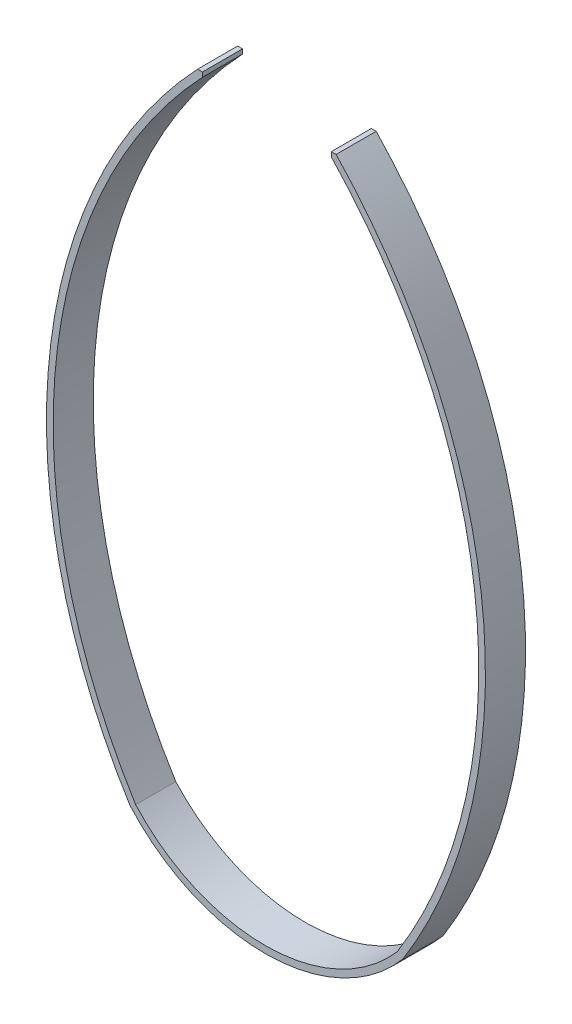
ISO-10303-21;
HEADER;
FILE_DESCRIPTION(('STEP AP214'),'2;1');
FILE_NAME('part.step','',(''),(''),'','','');
FILE_SCHEMA(('AUTOMOTIVE_DESIGN { 1 0 10303 214 1 1 1 1 }'));
ENDSEC;
DATA;
#1=APPLICATION_CONTEXT('core data for automotive mechanical design processes');
#2=APPLICATION_PROTOCOL_DEFINITION('international standard','automotive_design',2000,#1);
#3=PRODUCT_CONTEXT('',#1,'mechanical');
#4=PRODUCT('Part','Part','',(#3));
#5=PRODUCT_RELATED_PRODUCT_CATEGORY('part','',(#4));
#6=PRODUCT_DEFINITION_FORMATION('','',#4);
#7=PRODUCT_DEFINITION_CONTEXT('part definition',#1,'design');
#8=PRODUCT_DEFINITION('design','',#6,#7);
#9=PRODUCT_DEFINITION_SHAPE('','',#8);
#10=(LENGTH_UNIT() NAMED_UNIT(*) SI_UNIT(.MILLI.,.METRE.));
#11=(NAMED_UNIT(*) PLANE_ANGLE_UNIT() SI_UNIT($,.RADIAN.));
#12=(NAMED_UNIT(*) SI_UNIT($,.STERADIAN.) SOLID_ANGLE_UNIT());
#13=UNCERTAINTY_MEASURE_WITH_UNIT(LENGTH_MEASURE(1.E-05),#10,'distance_accuracy_value','');
#14=(GEOMETRIC_REPRESENTATION_CONTEXT(3) GLOBAL_UNCERTAINTY_ASSIGNED_CONTEXT((#13)) GLOBAL_UNIT_ASSIGNED_CONTEXT((#10,
#11,#12)) REPRESENTATION_CONTEXT('',''));
#15=CARTESIAN_POINT('',(0.,0.,0.));
#16=DIRECTION('',(0.,0.,1.));
#17=DIRECTION('',(1.,0.,0.));
#18=AXIS2_PLACEMENT_3D('',#15,#16,#17);
#19=CARTESIAN_POINT('',(246.446674144298,-17.5416481141906,30.));
#20=DIRECTION('',(0.,0.,-1.));
#21=DIRECTION('',(-1.,0.,0.));
#22=AXIS2_PLACEMENT_3D('',#19,#20,#21);
#23=CYLINDRICAL_SURFACE('',#22,408.152597482602);
#24=CARTESIAN_POINT('',(246.446674144298,-17.5416481141906,0.));
#25=DIRECTION('',(0.,0.,-1.));
#26=DIRECTION('',(1.,0.,0.));
#27=AXIS2_PLACEMENT_3D('',#24,#25,#26);
#28=CIRCLE('',#27,408.152597482602);
#29=CARTESIAN_POINT('',(-99.9773100852347,-233.363254961909,0.));
#30=VERTEX_POINT('',#29);
#31=CARTESIAN_POINT('',(-50.,263.007656323691,0.));
#32=VERTEX_POINT('',#31);
#33=EDGE_CURVE('E140',#30,#32,#28,.T.);
#34=ORIENTED_EDGE('',*,*,#33,.T.);
#35=DIRECTION('',(0.,0.,-1.));
#36=VECTOR('',#35,1.);
#37=CARTESIAN_POINT('',(-50.,263.007656323691,30.));
#38=LINE('',#37,#36);
#39=CARTESIAN_POINT('',(-50.,263.007656323691,30.));
#40=VERTEX_POINT('',#39);
#41=EDGE_CURVE('E11',#40,#32,#38,.T.);
#42=ORIENTED_EDGE('',*,*,#41,.F.);
#43=CARTESIAN_POINT('',(246.446674144298,-17.5416481141906,30.));
#44=DIRECTION('',(0.,0.,-1.));
#45=DIRECTION('',(1.,0.,0.));
#46=AXIS2_PLACEMENT_3D('',#43,#44,#45);
#47=CIRCLE('',#46,408.152597482602);
#48=CARTESIAN_POINT('',(-99.9773100852347,-233.363254961909,30.));
#49=VERTEX_POINT('',#48);
#50=EDGE_CURVE('E158',#49,#40,#47,.T.);
#51=ORIENTED_EDGE('',*,*,#50,.F.);
#52=DIRECTION('',(0.,0.,-1.));
#53=VECTOR('',#52,1.);
#54=CARTESIAN_POINT('',(-99.9773100852347,-233.363254961909,30.));
#55=LINE('',#54,#53);
#56=EDGE_CURVE('E136',#49,#30,#55,.T.);
#57=ORIENTED_EDGE('',*,*,#56,.T.);
#58=EDGE_LOOP('',(#34,#42,#51,#57));
#59=FACE_BOUND('',#58,.T.);
#60=ADVANCED_FACE('F32',(#59),#23,.F.);
#61=CARTESIAN_POINT('',(-50.,266.444475128327,30.));
#62=DIRECTION('',(-1.,0.,0.));
#63=DIRECTION('',(0.,0.,1.));
#64=AXIS2_PLACEMENT_3D('',#61,#62,#63);
#65=PLANE('',#64);
#66=DIRECTION('',(0.,1.,0.));
#67=VECTOR('',#66,1.);
#68=CARTESIAN_POINT('',(-50.,266.444475128327,0.));
#69=LINE('',#68,#67);
#70=CARTESIAN_POINT('',(-50.,266.444475128327,0.));
#71=VERTEX_POINT('',#70);
#72=EDGE_CURVE('E143',#32,#71,#69,.T.);
#73=ORIENTED_EDGE('',*,*,#72,.T.);
#74=DIRECTION('',(0.,0.,-1.));
#75=VECTOR('',#74,1.);
#76=CARTESIAN_POINT('',(-50.,266.444475128327,30.));
#77=LINE('',#76,#75);
#78=CARTESIAN_POINT('',(-50.,266.444475128327,30.));
#79=VERTEX_POINT('',#78);
#80=EDGE_CURVE('E40',#79,#71,#77,.T.);
#81=ORIENTED_EDGE('',*,*,#80,.F.);
#82=DIRECTION('',(0.,1.,0.));
#83=VECTOR('',#82,1.);
#84=CARTESIAN_POINT('',(-50.,266.444475128327,30.));
#85=LINE('',#84,#83);
#86=EDGE_CURVE('E97',#40,#79,#85,.T.);
#87=ORIENTED_EDGE('',*,*,#86,.F.);
#88=ORIENTED_EDGE('',*,*,#41,.T.);
#89=EDGE_LOOP('',(#73,#81,#87,#88));
#90=FACE_BOUND('',#89,.T.);
#91=ADVANCED_FACE('F207',(#90),#65,.F.);
#92=CARTESIAN_POINT('',(-53.6315666735031,266.444475128327,30.));
#93=DIRECTION('',(0.,-1.,0.));
#94=DIRECTION('',(0.,0.,-1.));
#95=AXIS2_PLACEMENT_3D('',#92,#93,#94);
#96=PLANE('',#95);
#97=DIRECTION('',(-1.,0.,0.));
#98=VECTOR('',#97,1.);
#99=CARTESIAN_POINT('',(-53.6315666735031,266.444475128327,0.));
#100=LINE('',#99,#98);
#101=CARTESIAN_POINT('',(-53.6315666735031,266.444475128327,0.));
#102=VERTEX_POINT('',#101);
#103=EDGE_CURVE('E145',#71,#102,#100,.T.);
#104=ORIENTED_EDGE('',*,*,#103,.T.);
#105=DIRECTION('',(0.,0.,-1.));
#106=VECTOR('',#105,1.);
#107=CARTESIAN_POINT('',(-53.6315666735031,266.444475128327,30.));
#108=LINE('',#107,#106);
#109=CARTESIAN_POINT('',(-53.6315666735031,266.444475128327,30.));
#110=VERTEX_POINT('',#109);
#111=EDGE_CURVE('E171',#110,#102,#108,.T.);
#112=ORIENTED_EDGE('',*,*,#111,.F.);
#113=DIRECTION('',(-1.,0.,0.));
#114=VECTOR('',#113,1.);
#115=CARTESIAN_POINT('',(-53.6315666735031,266.444475128327,30.));
#116=LINE('',#115,#114);
#117=EDGE_CURVE('E179',#79,#110,#116,.T.);
#118=ORIENTED_EDGE('',*,*,#117,.F.);
#119=ORIENTED_EDGE('',*,*,#80,.T.);
#120=EDGE_LOOP('',(#104,#112,#118,#119));
#121=FACE_BOUND('',#120,.T.);
#122=ADVANCED_FACE('F177',(#121),#96,.F.);
#123=CARTESIAN_POINT('',(246.446674144298,-17.5416481141906,30.));
#124=DIRECTION('',(0.,0.,-1.));
#125=DIRECTION('',(-1.,0.,0.));
#126=AXIS2_PLACEMENT_3D('',#123,#124,#125);
#127=CYLINDRICAL_SURFACE('',#126,413.152597482602);
#128=CARTESIAN_POINT('',(246.446674144298,-17.5416481141906,0.));
#129=DIRECTION('',(0.,0.,1.));
#130=DIRECTION('',(1.,0.,0.));
#131=AXIS2_PLACEMENT_3D('',#128,#129,#130);
#132=CIRCLE('',#131,413.152597482602);
#133=CARTESIAN_POINT('',(-104.221114808838,-236.007138746783,0.));
#134=VERTEX_POINT('',#133);
#135=EDGE_CURVE('E147',#102,#134,#132,.T.);
#136=ORIENTED_EDGE('',*,*,#135,.T.);
#137=DIRECTION('',(0.,0.,-1.));
#138=VECTOR('',#137,1.);
#139=CARTESIAN_POINT('',(-104.221114808838,-236.007138746783,30.));
#140=LINE('',#139,#138);
#141=CARTESIAN_POINT('',(-104.221114808838,-236.007138746783,30.));
#142=VERTEX_POINT('',#141);
#143=EDGE_CURVE('E168',#142,#134,#140,.T.);
#144=ORIENTED_EDGE('',*,*,#143,.F.);
#145=CARTESIAN_POINT('',(246.446674144298,-17.5416481141906,30.));
#146=DIRECTION('',(0.,0.,1.));
#147=DIRECTION('',(1.,0.,0.));
#148=AXIS2_PLACEMENT_3D('',#145,#146,#147);
#149=CIRCLE('',#148,413.152597482602);
#150=EDGE_CURVE('E197',#110,#142,#149,.T.);
#151=ORIENTED_EDGE('',*,*,#150,.F.);
#152=ORIENTED_EDGE('',*,*,#111,.T.);
#153=EDGE_LOOP('',(#136,#144,#151,#152));
#154=FACE_BOUND('',#153,.T.);
#155=ADVANCED_FACE('F188',(#154),#127,.T.);
#156=CARTESIAN_POINT('',(-3.26554658618699,-146.356674021873,30.));
#157=DIRECTION('',(0.,0.,-1.));
#158=DIRECTION('',(-1.,0.,0.));
#159=AXIS2_PLACEMENT_3D('',#156,#157,#158);
#160=CYLINDRICAL_SURFACE('',#159,135.015675314205);
#161=CARTESIAN_POINT('',(-3.26554658618699,-146.356674021873,0.));
#162=DIRECTION('',(0.,0.,1.));
#163=DIRECTION('',(-1.,0.,0.));
#164=AXIS2_PLACEMENT_3D('',#161,#162,#163);
#165=CIRCLE('',#164,135.015675314205);
#166=CARTESIAN_POINT('',(99.9773100852347,-233.363254961909,0.));
#167=VERTEX_POINT('',#166);
#168=EDGE_CURVE('E149',#134,#167,#165,.T.);
#169=ORIENTED_EDGE('',*,*,#168,.T.);
#170=DIRECTION('',(0.,0.,-1.));
#171=VECTOR('',#170,1.);
#172=CARTESIAN_POINT('',(99.9773100852347,-233.363254961909,30.));
#173=LINE('',#172,#171);
#174=CARTESIAN_POINT('',(99.9773100852347,-233.363254961909,30.));
#175=VERTEX_POINT('',#174);
#176=EDGE_CURVE('E165',#175,#167,#173,.T.);
#177=ORIENTED_EDGE('',*,*,#176,.F.);
#178=CARTESIAN_POINT('',(-3.26554658618699,-146.356674021873,30.));
#179=DIRECTION('',(0.,0.,1.));
#180=DIRECTION('',(-1.,0.,0.));
#181=AXIS2_PLACEMENT_3D('',#178,#179,#180);
#182=CIRCLE('',#181,135.015675314205);
#183=EDGE_CURVE('E194',#142,#175,#182,.T.);
#184=ORIENTED_EDGE('',*,*,#183,.F.);
#185=ORIENTED_EDGE('',*,*,#143,.T.);
#186=EDGE_LOOP('',(#169,#177,#184,#185));
#187=FACE_BOUND('',#186,.T.);
#188=ADVANCED_FACE('F192',(#187),#160,.T.);
#189=CARTESIAN_POINT('',(-246.446674144298,-17.5416481141906,30.));
#190=DIRECTION('',(0.,0.,-1.));
#191=DIRECTION('',(-1.,0.,0.));
#192=AXIS2_PLACEMENT_3D('',#189,#190,#191);
#193=CYLINDRICAL_SURFACE('',#192,408.152597482602);
#194=CARTESIAN_POINT('',(-246.446674144298,-17.5416481141906,0.));
#195=DIRECTION('',(0.,0.,1.));
#196=DIRECTION('',(-1.,0.,0.));
#197=AXIS2_PLACEMENT_3D('',#194,#195,#196);
#198=CIRCLE('',#197,408.152597482602);
#199=CARTESIAN_POINT('',(50.,263.007656323691,0.));
#200=VERTEX_POINT('',#199);
#201=EDGE_CURVE('E151',#167,#200,#198,.T.);
#202=ORIENTED_EDGE('',*,*,#201,.T.);
#203=DIRECTION('',(0.,0.,-1.));
#204=VECTOR('',#203,1.);
#205=CARTESIAN_POINT('',(50.,263.007656323691,30.));
#206=LINE('',#205,#204);
#207=CARTESIAN_POINT('',(50.,263.007656323691,30.));
#208=VERTEX_POINT('',#207);
#209=EDGE_CURVE('E162',#208,#200,#206,.T.);
#210=ORIENTED_EDGE('',*,*,#209,.F.);
#211=CARTESIAN_POINT('',(-246.446674144298,-17.5416481141906,30.));
#212=DIRECTION('',(0.,0.,1.));
#213=DIRECTION('',(-1.,0.,0.));
#214=AXIS2_PLACEMENT_3D('',#211,#212,#213);
#215=CIRCLE('',#214,408.152597482602);
#216=EDGE_CURVE('E196',#175,#208,#215,.T.);
#217=ORIENTED_EDGE('',*,*,#216,.F.);
#218=ORIENTED_EDGE('',*,*,#176,.T.);
#219=EDGE_LOOP('',(#202,#210,#217,#218));
#220=FACE_BOUND('',#219,.T.);
#221=ADVANCED_FACE('F219',(#220),#193,.T.);
#222=CARTESIAN_POINT('',(46.3684333264971,263.007656323691,30.));
#223=DIRECTION('',(0.,-1.,0.));
#224=DIRECTION('',(0.,0.,-1.));
#225=AXIS2_PLACEMENT_3D('',#222,#223,#224);
#226=PLANE('',#225);
#227=DIRECTION('',(-1.,0.,0.));
#228=VECTOR('',#227,1.);
#229=CARTESIAN_POINT('',(46.3684333264971,263.007656323691,0.));
#230=LINE('',#229,#228);
#231=CARTESIAN_POINT('',(46.3684333264971,263.007656323691,0.));
#232=VERTEX_POINT('',#231);
#233=EDGE_CURVE('E153',#200,#232,#230,.T.);
#234=ORIENTED_EDGE('',*,*,#233,.T.);
#235=DIRECTION('',(0.,0.,-1.));
#236=VECTOR('',#235,1.);
#237=CARTESIAN_POINT('',(46.3684333264971,263.007656323691,30.));
#238=LINE('',#237,#236);
#239=CARTESIAN_POINT('',(46.3684333264971,263.007656323691,30.));
#240=VERTEX_POINT('',#239);
#241=EDGE_CURVE('E131',#240,#232,#238,.T.);
#242=ORIENTED_EDGE('',*,*,#241,.F.);
#243=DIRECTION('',(-1.,0.,0.));
#244=VECTOR('',#243,1.);
#245=CARTESIAN_POINT('',(46.3684333264971,263.007656323691,30.));
#246=LINE('',#245,#244);
#247=EDGE_CURVE('E122',#208,#240,#246,.T.);
#248=ORIENTED_EDGE('',*,*,#247,.F.);
#249=ORIENTED_EDGE('',*,*,#209,.T.);
#250=EDGE_LOOP('',(#234,#242,#248,#249));
#251=FACE_BOUND('',#250,.T.);
#252=ADVANCED_FACE('F222',(#251),#226,.F.);
#253=CARTESIAN_POINT('',(46.3684333264971,259.570837519054,30.));
#254=DIRECTION('',(1.,0.,0.));
#255=DIRECTION('',(0.,0.,-1.));
#256=AXIS2_PLACEMENT_3D('',#253,#254,#255);
#257=PLANE('',#256);
#258=DIRECTION('',(0.,-1.,0.));
#259=VECTOR('',#258,1.);
#260=CARTESIAN_POINT('',(46.3684333264971,259.570837519054,0.));
#261=LINE('',#260,#259);
#262=CARTESIAN_POINT('',(46.3684333264971,259.570837519054,0.));
#263=VERTEX_POINT('',#262);
#264=EDGE_CURVE('E130',#232,#263,#261,.T.);
#265=ORIENTED_EDGE('',*,*,#264,.T.);
#266=DIRECTION('',(0.,0.,-1.));
#267=VECTOR('',#266,1.);
#268=CARTESIAN_POINT('',(46.3684333264971,259.570837519054,30.));
#269=LINE('',#268,#267);
#270=CARTESIAN_POINT('',(46.3684333264971,259.570837519054,30.));
#271=VERTEX_POINT('',#270);
#272=EDGE_CURVE('E127',#271,#263,#269,.T.);
#273=ORIENTED_EDGE('',*,*,#272,.F.);
#274=DIRECTION('',(0.,-1.,0.));
#275=VECTOR('',#274,1.);
#276=CARTESIAN_POINT('',(46.3684333264971,259.570837519054,30.));
#277=LINE('',#276,#275);
#278=EDGE_CURVE('E116',#240,#271,#277,.T.);
#279=ORIENTED_EDGE('',*,*,#278,.F.);
#280=ORIENTED_EDGE('',*,*,#241,.T.);
#281=EDGE_LOOP('',(#265,#273,#279,#280));
#282=FACE_BOUND('',#281,.T.);
#283=ADVANCED_FACE('F128',(#282),#257,.F.);
#284=CARTESIAN_POINT('',(-246.446674144298,-17.5416481141906,30.));
#285=DIRECTION('',(0.,0.,-1.));
#286=DIRECTION('',(-1.,0.,0.));
#287=AXIS2_PLACEMENT_3D('',#284,#285,#286);
#288=CYLINDRICAL_SURFACE('',#287,403.152597482602);
#289=CARTESIAN_POINT('',(-246.446674144298,-17.5416481141906,0.));
#290=DIRECTION('',(0.,0.,-1.));
#291=DIRECTION('',(-1.,0.,0.));
#292=AXIS2_PLACEMENT_3D('',#289,#290,#291);
#293=CIRCLE('',#292,403.152597482602);
#294=CARTESIAN_POINT('',(95.7335053616312,-230.719371177035,0.));
#295=VERTEX_POINT('',#294);
#296=EDGE_CURVE('E83',#263,#295,#293,.T.);
#297=ORIENTED_EDGE('',*,*,#296,.T.);
#298=DIRECTION('',(0.,0.,-1.));
#299=VECTOR('',#298,1.);
#300=CARTESIAN_POINT('',(95.7335053616312,-230.719371177035,30.));
#301=LINE('',#300,#299);
#302=CARTESIAN_POINT('',(95.7335053616312,-230.719371177035,30.));
#303=VERTEX_POINT('',#302);
#304=EDGE_CURVE('E132',#303,#295,#301,.T.);
#305=ORIENTED_EDGE('',*,*,#304,.F.);
#306=CARTESIAN_POINT('',(-246.446674144298,-17.5416481141906,30.));
#307=DIRECTION('',(0.,0.,-1.));
#308=DIRECTION('',(-1.,0.,0.));
#309=AXIS2_PLACEMENT_3D('',#306,#307,#308);
#310=CIRCLE('',#309,403.152597482602);
#311=EDGE_CURVE('E120',#271,#303,#310,.T.);
#312=ORIENTED_EDGE('',*,*,#311,.F.);
#313=ORIENTED_EDGE('',*,*,#272,.T.);
#314=EDGE_LOOP('',(#297,#305,#312,#313));
#315=FACE_BOUND('',#314,.T.);
#316=ADVANCED_FACE('F134',(#315),#288,.F.);
#317=CARTESIAN_POINT('',(-3.29121983458323,-145.483773201959,30.));
#318=DIRECTION('',(0.,0.,-1.));
#319=DIRECTION('',(-1.,0.,0.));
#320=AXIS2_PLACEMENT_3D('',#317,#318,#319);
#321=CYLINDRICAL_SURFACE('',#320,130.656049849804);
#322=CARTESIAN_POINT('',(-3.29121983458323,-145.483773201959,0.));
#323=DIRECTION('',(0.,0.,-1.));
#324=DIRECTION('',(1.,0.,0.));
#325=AXIS2_PLACEMENT_3D('',#322,#323,#324);
#326=CIRCLE('',#325,130.656049849804);
#327=EDGE_CURVE('E89',#295,#30,#326,.T.);
#328=ORIENTED_EDGE('',*,*,#327,.T.);
#329=ORIENTED_EDGE('',*,*,#56,.F.);
#330=CARTESIAN_POINT('',(-3.29121983458323,-145.483773201959,30.));
#331=DIRECTION('',(0.,0.,-1.));
#332=DIRECTION('',(1.,0.,0.));
#333=AXIS2_PLACEMENT_3D('',#330,#331,#332);
#334=CIRCLE('',#333,130.656049849804);
#335=EDGE_CURVE('E48',#303,#49,#334,.T.);
#336=ORIENTED_EDGE('',*,*,#335,.F.);
#337=ORIENTED_EDGE('',*,*,#304,.T.);
#338=EDGE_LOOP('',(#328,#329,#336,#337));
#339=FACE_BOUND('',#338,.T.);
#340=ADVANCED_FACE('F231',(#339),#321,.F.);
#341=CARTESIAN_POINT('',(246.446674144298,-17.5416481141906,30.));
#342=DIRECTION('',(0.,0.,1.));
#343=DIRECTION('',(1.,0.,0.));
#344=AXIS2_PLACEMENT_3D('',#341,#342,#343);
#345=PLANE('',#344);
#346=ORIENTED_EDGE('',*,*,#50,.T.);
#347=ORIENTED_EDGE('',*,*,#86,.T.);
#348=ORIENTED_EDGE('',*,*,#117,.T.);
#349=ORIENTED_EDGE('',*,*,#150,.T.);
#350=ORIENTED_EDGE('',*,*,#183,.T.);
#351=ORIENTED_EDGE('',*,*,#216,.T.);
#352=ORIENTED_EDGE('',*,*,#247,.T.);
#353=ORIENTED_EDGE('',*,*,#278,.T.);
#354=ORIENTED_EDGE('',*,*,#311,.T.);
#355=ORIENTED_EDGE('',*,*,#335,.T.);
#356=EDGE_LOOP('',(#346,#347,#348,#349,#350,#351,#352,#353,#354,#355));
#357=FACE_BOUND('',#356,.T.);
#358=ADVANCED_FACE('F118',(#357),#345,.T.);
#359=CARTESIAN_POINT('',(246.446674144298,-17.5416481141906,0.));
#360=DIRECTION('',(0.,0.,1.));
#361=DIRECTION('',(1.,0.,0.));
#362=AXIS2_PLACEMENT_3D('',#359,#360,#361);
#363=PLANE('',#362);
#364=ORIENTED_EDGE('',*,*,#33,.F.);
#365=ORIENTED_EDGE('',*,*,#327,.F.);
#366=ORIENTED_EDGE('',*,*,#296,.F.);
#367=ORIENTED_EDGE('',*,*,#264,.F.);
#368=ORIENTED_EDGE('',*,*,#233,.F.);
#369=ORIENTED_EDGE('',*,*,#201,.F.);
#370=ORIENTED_EDGE('',*,*,#168,.F.);
#371=ORIENTED_EDGE('',*,*,#135,.F.);
#372=ORIENTED_EDGE('',*,*,#103,.F.);
#373=ORIENTED_EDGE('',*,*,#72,.F.);
#374=EDGE_LOOP('',(#364,#365,#366,#367,#368,#369,#370,#371,#372,#373));
#375=FACE_BOUND('',#374,.T.);
#376=ADVANCED_FACE('F183',(#375),#363,.F.);
#377=CLOSED_SHELL('',(#60,#91,#122,#155,#188,#221,#252,#283,#316,#340,#358,#376));
#378=MANIFOLD_SOLID_BREP('B2',#377);
#379=ADVANCED_BREP_SHAPE_REPRESENTATION('',(#18,#378),#14);
#380=SHAPE_DEFINITION_REPRESENTATION(#9,#379);
ENDSEC;
END-ISO-10303-21;
